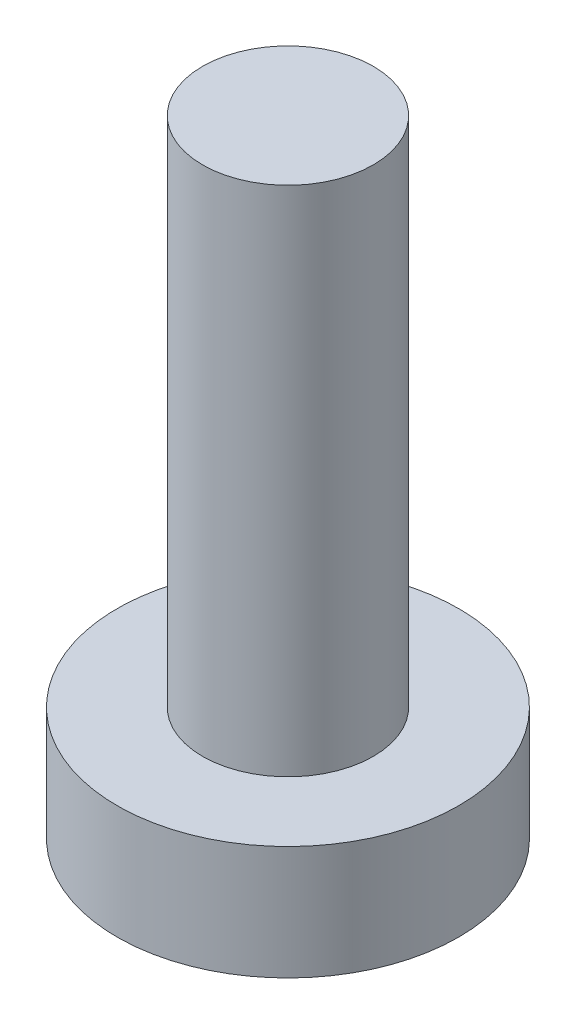
ISO-10303-21;
HEADER;
FILE_DESCRIPTION(('STEP AP214'),'2;1');
FILE_NAME('part.step','',(''),(''),'','','');
FILE_SCHEMA(('AUTOMOTIVE_DESIGN { 1 0 10303 214 1 1 1 1 }'));
ENDSEC;
DATA;
#1=APPLICATION_CONTEXT('core data for automotive mechanical design processes');
#2=APPLICATION_PROTOCOL_DEFINITION('international standard','automotive_design',2000,#1);
#3=PRODUCT_CONTEXT('',#1,'mechanical');
#4=PRODUCT('Part','Part','',(#3));
#5=PRODUCT_RELATED_PRODUCT_CATEGORY('part','',(#4));
#6=PRODUCT_DEFINITION_FORMATION('','',#4);
#7=PRODUCT_DEFINITION_CONTEXT('part definition',#1,'design');
#8=PRODUCT_DEFINITION('design','',#6,#7);
#9=PRODUCT_DEFINITION_SHAPE('','',#8);
#10=(LENGTH_UNIT() NAMED_UNIT(*) SI_UNIT(.MILLI.,.METRE.));
#11=(NAMED_UNIT(*) PLANE_ANGLE_UNIT() SI_UNIT($,.RADIAN.));
#12=(NAMED_UNIT(*) SI_UNIT($,.STERADIAN.) SOLID_ANGLE_UNIT());
#13=UNCERTAINTY_MEASURE_WITH_UNIT(LENGTH_MEASURE(1.E-05),#10,'distance_accuracy_value','');
#14=(GEOMETRIC_REPRESENTATION_CONTEXT(3) GLOBAL_UNCERTAINTY_ASSIGNED_CONTEXT((#13)) GLOBAL_UNIT_ASSIGNED_CONTEXT((#10,
#11,#12)) REPRESENTATION_CONTEXT('',''));
#15=CARTESIAN_POINT('',(0.,0.,0.));
#16=DIRECTION('',(0.,0.,1.));
#17=DIRECTION('',(1.,0.,0.));
#18=AXIS2_PLACEMENT_3D('',#15,#16,#17);
#19=CARTESIAN_POINT('',(0.,9.,0.));
#20=DIRECTION('',(0.,-1.,0.));
#21=DIRECTION('',(0.,0.,-1.));
#22=AXIS2_PLACEMENT_3D('',#19,#20,#21);
#23=CYLINDRICAL_SURFACE('',#22,1.5);
#24=CARTESIAN_POINT('',(0.,9.,0.));
#25=DIRECTION('',(0.,1.,0.));
#26=DIRECTION('',(1.,0.,0.));
#27=AXIS2_PLACEMENT_3D('',#24,#25,#26);
#28=CIRCLE('',#27,1.5);
#29=CARTESIAN_POINT('',(1.5,9.,0.));
#30=VERTEX_POINT('',#29);
#31=EDGE_CURVE('E9',#30,#30,#28,.T.);
#32=ORIENTED_EDGE('',*,*,#31,.F.);
#33=EDGE_LOOP('',(#32));
#34=FACE_BOUND('',#33,.T.);
#35=CARTESIAN_POINT('',(0.,0.,0.));
#36=DIRECTION('',(0.,1.,0.));
#37=DIRECTION('',(0.,0.,1.));
#38=AXIS2_PLACEMENT_3D('',#35,#36,#37);
#39=CIRCLE('',#38,1.5);
#40=CARTESIAN_POINT('',(0.,0.,1.5));
#41=VERTEX_POINT('',#40);
#42=EDGE_CURVE('E20',#41,#41,#39,.T.);
#43=ORIENTED_EDGE('',*,*,#42,.T.);
#44=EDGE_LOOP('',(#43));
#45=FACE_BOUND('',#44,.T.);
#46=ADVANCED_FACE('F14',(#34,#45),#23,.T.);
#47=CARTESIAN_POINT('',(0.,9.,0.));
#48=DIRECTION('',(0.,1.,0.));
#49=DIRECTION('',(0.,0.,1.));
#50=AXIS2_PLACEMENT_3D('',#47,#48,#49);
#51=PLANE('',#50);
#52=ORIENTED_EDGE('',*,*,#31,.T.);
#53=EDGE_LOOP('',(#52));
#54=FACE_BOUND('',#53,.T.);
#55=ADVANCED_FACE('F54',(#54),#51,.T.);
#56=CARTESIAN_POINT('',(0.,0.,0.));
#57=DIRECTION('',(0.,1.,0.));
#58=DIRECTION('',(0.,0.,1.));
#59=AXIS2_PLACEMENT_3D('',#56,#57,#58);
#60=PLANE('',#59);
#61=CARTESIAN_POINT('',(0.,0.,0.));
#62=DIRECTION('',(0.,1.,0.));
#63=DIRECTION('',(1.,0.,0.));
#64=AXIS2_PLACEMENT_3D('',#61,#62,#63);
#65=CIRCLE('',#64,3.);
#66=CARTESIAN_POINT('',(3.,0.,0.));
#67=VERTEX_POINT('',#66);
#68=EDGE_CURVE('E32',#67,#67,#65,.T.);
#69=ORIENTED_EDGE('',*,*,#68,.T.);
#70=EDGE_LOOP('',(#69));
#71=FACE_BOUND('',#70,.T.);
#72=ORIENTED_EDGE('',*,*,#42,.F.);
#73=EDGE_LOOP('',(#72));
#74=FACE_BOUND('',#73,.T.);
#75=ADVANCED_FACE('F39',(#71,#74),#60,.T.);
#76=CARTESIAN_POINT('',(0.,-2.,0.));
#77=DIRECTION('',(0.,1.,0.));
#78=DIRECTION('',(0.,0.,1.));
#79=AXIS2_PLACEMENT_3D('',#76,#77,#78);
#80=CYLINDRICAL_SURFACE('',#79,3.);
#81=CARTESIAN_POINT('',(0.,-2.,0.));
#82=DIRECTION('',(0.,1.,0.));
#83=DIRECTION('',(1.,0.,0.));
#84=AXIS2_PLACEMENT_3D('',#81,#82,#83);
#85=CIRCLE('',#84,3.);
#86=CARTESIAN_POINT('',(3.,-2.,0.));
#87=VERTEX_POINT('',#86);
#88=EDGE_CURVE('E25',#87,#87,#85,.T.);
#89=ORIENTED_EDGE('',*,*,#88,.T.);
#90=EDGE_LOOP('',(#89));
#91=FACE_BOUND('',#90,.T.);
#92=ORIENTED_EDGE('',*,*,#68,.F.);
#93=EDGE_LOOP('',(#92));
#94=FACE_BOUND('',#93,.T.);
#95=ADVANCED_FACE('F42',(#91,#94),#80,.T.);
#96=CARTESIAN_POINT('',(0.,-2.,0.));
#97=DIRECTION('',(0.,1.,0.));
#98=DIRECTION('',(0.,0.,1.));
#99=AXIS2_PLACEMENT_3D('',#96,#97,#98);
#100=PLANE('',#99);
#101=ORIENTED_EDGE('',*,*,#88,.F.);
#102=EDGE_LOOP('',(#101));
#103=FACE_BOUND('',#102,.T.);
#104=ADVANCED_FACE('F44',(#103),#100,.F.);
#105=CLOSED_SHELL('',(#46,#55,#75,#95,#104));
#106=MANIFOLD_SOLID_BREP('B1',#105);
#107=ADVANCED_BREP_SHAPE_REPRESENTATION('',(#18,#106),#14);
#108=SHAPE_DEFINITION_REPRESENTATION(#9,#107);
ENDSEC;
END-ISO-10303-21;
